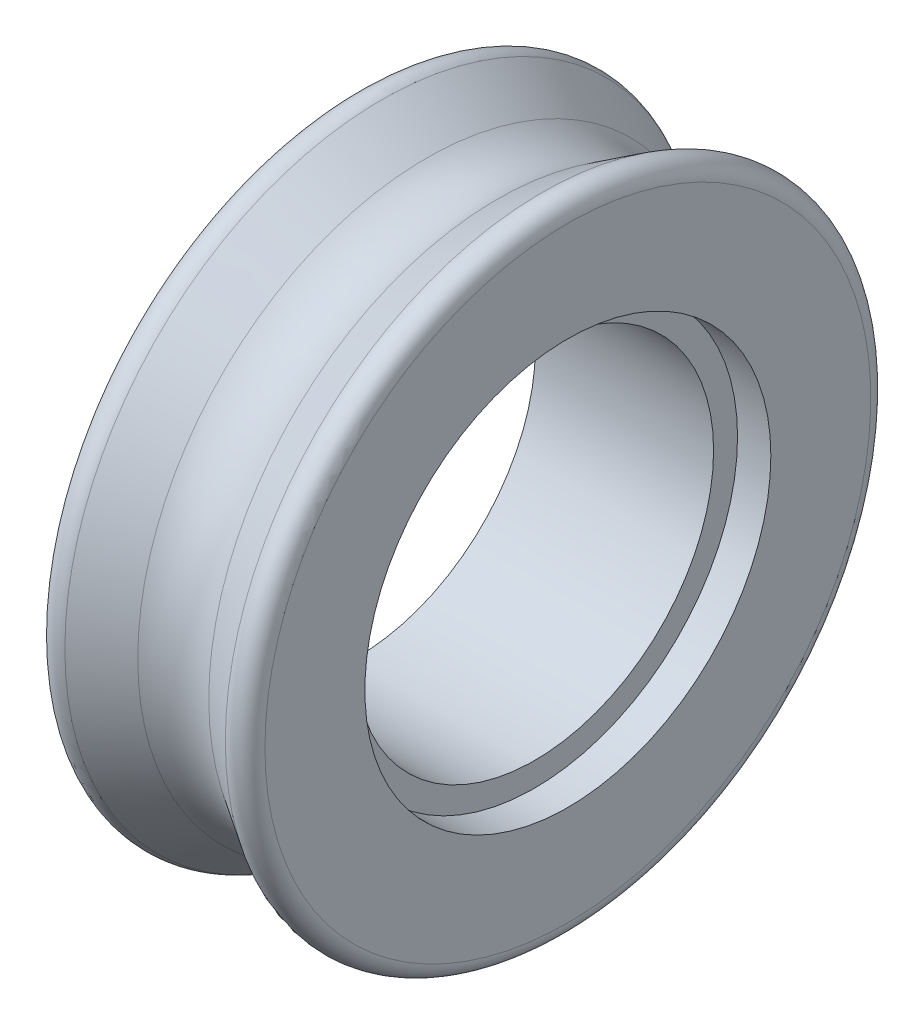
ISO-10303-21;
HEADER;
FILE_DESCRIPTION(('STEP AP214'),'2;1');
FILE_NAME('part.step','',(''),(''),'','','');
FILE_SCHEMA(('AUTOMOTIVE_DESIGN { 1 0 10303 214 1 1 1 1 }'));
ENDSEC;
DATA;
#1=APPLICATION_CONTEXT('core data for automotive mechanical design processes');
#2=APPLICATION_PROTOCOL_DEFINITION('international standard','automotive_design',2000,#1);
#3=PRODUCT_CONTEXT('',#1,'mechanical');
#4=PRODUCT('Part','Part','',(#3));
#5=PRODUCT_RELATED_PRODUCT_CATEGORY('part','',(#4));
#6=PRODUCT_DEFINITION_FORMATION('','',#4);
#7=PRODUCT_DEFINITION_CONTEXT('part definition',#1,'design');
#8=PRODUCT_DEFINITION('design','',#6,#7);
#9=PRODUCT_DEFINITION_SHAPE('','',#8);
#10=(LENGTH_UNIT() NAMED_UNIT(*) SI_UNIT(.MILLI.,.METRE.));
#11=(NAMED_UNIT(*) PLANE_ANGLE_UNIT() SI_UNIT($,.RADIAN.));
#12=(NAMED_UNIT(*) SI_UNIT($,.STERADIAN.) SOLID_ANGLE_UNIT());
#13=UNCERTAINTY_MEASURE_WITH_UNIT(LENGTH_MEASURE(1.E-05),#10,'distance_accuracy_value','');
#14=(GEOMETRIC_REPRESENTATION_CONTEXT(3) GLOBAL_UNCERTAINTY_ASSIGNED_CONTEXT((#13)) GLOBAL_UNIT_ASSIGNED_CONTEXT((#10,
#11,#12)) REPRESENTATION_CONTEXT('',''));
#15=CARTESIAN_POINT('',(0.,0.,0.));
#16=DIRECTION('',(0.,0.,1.));
#17=DIRECTION('',(1.,0.,0.));
#18=AXIS2_PLACEMENT_3D('',#15,#16,#17);
#19=CARTESIAN_POINT('',(6.35,0.,0.));
#20=DIRECTION('',(-1.,0.,0.));
#21=DIRECTION('',(0.,0.,1.));
#22=AXIS2_PLACEMENT_3D('',#19,#20,#21);
#23=PLANE('',#22);
#24=CARTESIAN_POINT('',(6.35,0.,0.));
#25=DIRECTION('',(1.,0.,0.));
#26=DIRECTION('',(0.,0.,-1.));
#27=AXIS2_PLACEMENT_3D('',#24,#25,#26);
#28=CIRCLE('',#27,6.09410773410009);
#29=CARTESIAN_POINT('',(6.35,0.,-6.09410773410009));
#30=VERTEX_POINT('',#29);
#31=EDGE_CURVE('E70',#30,#30,#28,.T.);
#32=ORIENTED_EDGE('',*,*,#31,.F.);
#33=EDGE_LOOP('',(#32));
#34=FACE_BOUND('',#33,.T.);
#35=CARTESIAN_POINT('',(6.35,0.,0.));
#36=DIRECTION('',(-1.,0.,0.));
#37=DIRECTION('',(0.,0.,1.));
#38=AXIS2_PLACEMENT_3D('',#35,#36,#37);
#39=CIRCLE('',#38,9.09410773410009);
#40=CARTESIAN_POINT('',(6.35,0.,9.09410773410009));
#41=VERTEX_POINT('',#40);
#42=EDGE_CURVE('E61',#41,#41,#39,.F.);
#43=ORIENTED_EDGE('',*,*,#42,.T.);
#44=EDGE_LOOP('',(#43));
#45=FACE_BOUND('',#44,.T.);
#46=ADVANCED_FACE('F37',(#34,#45),#23,.F.);
#47=CARTESIAN_POINT('',(6.35,0.,0.));
#48=DIRECTION('',(1.,0.,0.));
#49=DIRECTION('',(0.,0.,-1.));
#50=AXIS2_PLACEMENT_3D('',#47,#48,#49);
#51=CONICAL_SURFACE('',#50,10.,0.562130374114294);
#52=CARTESIAN_POINT('',(4.24097992304018,0.,0.));
#53=DIRECTION('',(-1.,0.,0.));
#54=DIRECTION('',(0.,0.,1.));
#55=AXIS2_PLACEMENT_3D('',#52,#53,#54);
#56=CIRCLE('',#55,8.6714834160883);
#57=CARTESIAN_POINT('',(4.24097992304018,0.,8.6714834160883));
#58=VERTEX_POINT('',#57);
#59=EDGE_CURVE('E10',#58,#58,#56,.F.);
#60=ORIENTED_EDGE('',*,*,#59,.T.);
#61=EDGE_LOOP('',(#60));
#62=FACE_BOUND('',#61,.T.);
#63=CARTESIAN_POINT('',(5.58350501923995,0.,0.));
#64=DIRECTION('',(-1.,0.,0.));
#65=DIRECTION('',(0.,0.,1.));
#66=AXIS2_PLACEMENT_3D('',#63,#64,#65);
#67=CIRCLE('',#66,9.51716851605666);
#68=CARTESIAN_POINT('',(5.58350501923995,0.,9.51716851605666));
#69=VERTEX_POINT('',#68);
#70=EDGE_CURVE('E65',#69,#69,#67,.T.);
#71=ORIENTED_EDGE('',*,*,#70,.T.);
#72=EDGE_LOOP('',(#71));
#73=FACE_BOUND('',#72,.T.);
#74=ADVANCED_FACE('F109',(#62,#73),#51,.T.);
#75=CARTESIAN_POINT('',(0.,0.,0.));
#76=DIRECTION('',(-1.,0.,0.));
#77=DIRECTION('',(0.,0.,1.));
#78=AXIS2_PLACEMENT_3D('',#75,#76,#77);
#79=CONICAL_SURFACE('',#78,10.,0.562130374114294);
#80=CARTESIAN_POINT('',(2.10902007695982,0.,0.));
#81=DIRECTION('',(1.,0.,0.));
#82=DIRECTION('',(0.,0.,-1.));
#83=AXIS2_PLACEMENT_3D('',#80,#81,#82);
#84=CIRCLE('',#83,8.6714834160883);
#85=CARTESIAN_POINT('',(2.10902007695982,0.,-8.6714834160883));
#86=VERTEX_POINT('',#85);
#87=EDGE_CURVE('E45',#86,#86,#84,.F.);
#88=ORIENTED_EDGE('',*,*,#87,.T.);
#89=EDGE_LOOP('',(#88));
#90=FACE_BOUND('',#89,.T.);
#91=CARTESIAN_POINT('',(0.766494980760042,0.,0.));
#92=DIRECTION('',(1.,0.,0.));
#93=DIRECTION('',(0.,0.,-1.));
#94=AXIS2_PLACEMENT_3D('',#91,#92,#93);
#95=CIRCLE('',#94,9.51716851605667);
#96=CARTESIAN_POINT('',(0.766494980760042,0.,-9.51716851605667));
#97=VERTEX_POINT('',#96);
#98=EDGE_CURVE('E50',#97,#97,#95,.T.);
#99=ORIENTED_EDGE('',*,*,#98,.T.);
#100=EDGE_LOOP('',(#99));
#101=FACE_BOUND('',#100,.T.);
#102=ADVANCED_FACE('F121',(#90,#101),#79,.T.);
#103=CARTESIAN_POINT('',(0.,0.,0.));
#104=DIRECTION('',(-1.,0.,0.));
#105=DIRECTION('',(0.,0.,1.));
#106=AXIS2_PLACEMENT_3D('',#103,#104,#105);
#107=PLANE('',#106);
#108=CARTESIAN_POINT('',(0.,0.,0.));
#109=DIRECTION('',(1.,0.,0.));
#110=DIRECTION('',(0.,0.,-1.));
#111=AXIS2_PLACEMENT_3D('',#108,#109,#110);
#112=CIRCLE('',#111,5.375);
#113=CARTESIAN_POINT('',(0.,0.,-5.375));
#114=VERTEX_POINT('',#113);
#115=EDGE_CURVE('E74',#114,#114,#112,.T.);
#116=ORIENTED_EDGE('',*,*,#115,.T.);
#117=EDGE_LOOP('',(#116));
#118=FACE_BOUND('',#117,.T.);
#119=CARTESIAN_POINT('',(0.,0.,0.));
#120=DIRECTION('',(-1.,0.,0.));
#121=DIRECTION('',(0.,0.,1.));
#122=AXIS2_PLACEMENT_3D('',#119,#120,#121);
#123=CIRCLE('',#122,9.09410773410009);
#124=CARTESIAN_POINT('',(0.,0.,9.09410773410009));
#125=VERTEX_POINT('',#124);
#126=EDGE_CURVE('E55',#125,#125,#123,.T.);
#127=ORIENTED_EDGE('',*,*,#126,.T.);
#128=EDGE_LOOP('',(#127));
#129=FACE_BOUND('',#128,.T.);
#130=ADVANCED_FACE('F86',(#118,#129),#107,.T.);
#131=CARTESIAN_POINT('',(5.85,0.,0.));
#132=DIRECTION('',(-1.,0.,0.));
#133=DIRECTION('',(0.,0.,1.));
#134=AXIS2_PLACEMENT_3D('',#131,#132,#133);
#135=TOROIDAL_SURFACE('',#134,9.09410773410009,0.5);
#136=ORIENTED_EDGE('',*,*,#42,.F.);
#137=EDGE_LOOP('',(#136));
#138=FACE_BOUND('',#137,.T.);
#139=ORIENTED_EDGE('',*,*,#70,.F.);
#140=EDGE_LOOP('',(#139));
#141=FACE_BOUND('',#140,.T.);
#142=ADVANCED_FACE('F113',(#138,#141),#135,.T.);
#143=CARTESIAN_POINT('',(0.5,0.,0.));
#144=DIRECTION('',(-1.,0.,0.));
#145=DIRECTION('',(0.,0.,1.));
#146=AXIS2_PLACEMENT_3D('',#143,#144,#145);
#147=TOROIDAL_SURFACE('',#146,9.09410773410009,0.5);
#148=ORIENTED_EDGE('',*,*,#98,.F.);
#149=EDGE_LOOP('',(#148));
#150=FACE_BOUND('',#149,.T.);
#151=ORIENTED_EDGE('',*,*,#126,.F.);
#152=EDGE_LOOP('',(#151));
#153=FACE_BOUND('',#152,.T.);
#154=ADVANCED_FACE('F116',(#150,#153),#147,.T.);
#155=CARTESIAN_POINT('',(3.175,0.,0.));
#156=DIRECTION('',(-1.,0.,0.));
#157=DIRECTION('',(0.,0.,1.));
#158=AXIS2_PLACEMENT_3D('',#155,#156,#157);
#159=TOROIDAL_SURFACE('',#158,10.3637265439146,2.);
#160=ORIENTED_EDGE('',*,*,#59,.F.);
#161=EDGE_LOOP('',(#160));
#162=FACE_BOUND('',#161,.T.);
#163=ORIENTED_EDGE('',*,*,#87,.F.);
#164=EDGE_LOOP('',(#163));
#165=FACE_BOUND('',#164,.T.);
#166=ADVANCED_FACE('F39',(#162,#165),#159,.F.);
#167=CARTESIAN_POINT('',(5.35,0.,0.));
#168=DIRECTION('',(1.,0.,0.));
#169=DIRECTION('',(0.,0.,-1.));
#170=AXIS2_PLACEMENT_3D('',#167,#168,#169);
#171=CYLINDRICAL_SURFACE('',#170,6.09410773410009);
#172=CARTESIAN_POINT('',(5.35,0.,0.));
#173=DIRECTION('',(1.,0.,0.));
#174=DIRECTION('',(0.,0.,-1.));
#175=AXIS2_PLACEMENT_3D('',#172,#173,#174);
#176=CIRCLE('',#175,6.09410773410009);
#177=CARTESIAN_POINT('',(5.35,0.,-6.09410773410009));
#178=VERTEX_POINT('',#177);
#179=EDGE_CURVE('E69',#178,#178,#176,.T.);
#180=ORIENTED_EDGE('',*,*,#179,.F.);
#181=EDGE_LOOP('',(#180));
#182=FACE_BOUND('',#181,.T.);
#183=ORIENTED_EDGE('',*,*,#31,.T.);
#184=EDGE_LOOP('',(#183));
#185=FACE_BOUND('',#184,.T.);
#186=ADVANCED_FACE('F98',(#182,#185),#171,.F.);
#187=CARTESIAN_POINT('',(5.35,0.,0.));
#188=DIRECTION('',(1.,0.,0.));
#189=DIRECTION('',(0.,0.,-1.));
#190=AXIS2_PLACEMENT_3D('',#187,#188,#189);
#191=PLANE('',#190);
#192=CARTESIAN_POINT('',(5.35,0.,0.));
#193=DIRECTION('',(1.,0.,0.));
#194=DIRECTION('',(0.,0.,-1.));
#195=AXIS2_PLACEMENT_3D('',#192,#193,#194);
#196=CIRCLE('',#195,5.375);
#197=CARTESIAN_POINT('',(5.35,0.,-5.375));
#198=VERTEX_POINT('',#197);
#199=EDGE_CURVE('E78',#198,#198,#196,.T.);
#200=ORIENTED_EDGE('',*,*,#199,.F.);
#201=EDGE_LOOP('',(#200));
#202=FACE_BOUND('',#201,.T.);
#203=ORIENTED_EDGE('',*,*,#179,.T.);
#204=EDGE_LOOP('',(#203));
#205=FACE_BOUND('',#204,.T.);
#206=ADVANCED_FACE('F92',(#202,#205),#191,.T.);
#207=CARTESIAN_POINT('',(0.,0.,0.));
#208=DIRECTION('',(1.,0.,0.));
#209=DIRECTION('',(0.,0.,-1.));
#210=AXIS2_PLACEMENT_3D('',#207,#208,#209);
#211=CYLINDRICAL_SURFACE('',#210,5.375);
#212=ORIENTED_EDGE('',*,*,#115,.F.);
#213=EDGE_LOOP('',(#212));
#214=FACE_BOUND('',#213,.T.);
#215=ORIENTED_EDGE('',*,*,#199,.T.);
#216=EDGE_LOOP('',(#215));
#217=FACE_BOUND('',#216,.T.);
#218=ADVANCED_FACE('F89',(#214,#217),#211,.F.);
#219=CLOSED_SHELL('',(#46,#74,#102,#130,#142,#154,#166,#186,#206,#218));
#220=MANIFOLD_SOLID_BREP('B2',#219);
#221=ADVANCED_BREP_SHAPE_REPRESENTATION('',(#18,#220),#14);
#222=SHAPE_DEFINITION_REPRESENTATION(#9,#221);
ENDSEC;
END-ISO-10303-21;
